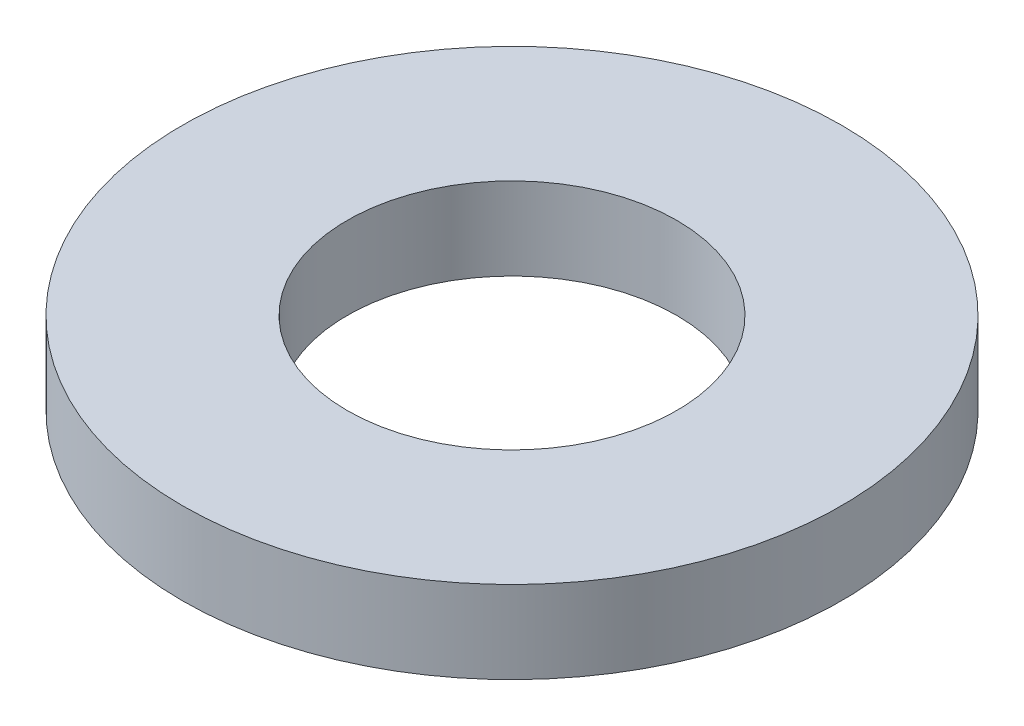
ISO-10303-21;
HEADER;
FILE_DESCRIPTION(('STEP AP214'),'2;1');
FILE_NAME('part.step','',(''),(''),'','','');
FILE_SCHEMA(('AUTOMOTIVE_DESIGN { 1 0 10303 214 1 1 1 1 }'));
ENDSEC;
DATA;
#1=APPLICATION_CONTEXT('core data for automotive mechanical design processes');
#2=APPLICATION_PROTOCOL_DEFINITION('international standard','automotive_design',2000,#1);
#3=PRODUCT_CONTEXT('',#1,'mechanical');
#4=PRODUCT('Part','Part','',(#3));
#5=PRODUCT_RELATED_PRODUCT_CATEGORY('part','',(#4));
#6=PRODUCT_DEFINITION_FORMATION('','',#4);
#7=PRODUCT_DEFINITION_CONTEXT('part definition',#1,'design');
#8=PRODUCT_DEFINITION('design','',#6,#7);
#9=PRODUCT_DEFINITION_SHAPE('','',#8);
#10=(LENGTH_UNIT() NAMED_UNIT(*) SI_UNIT(.MILLI.,.METRE.));
#11=(NAMED_UNIT(*) PLANE_ANGLE_UNIT() SI_UNIT($,.RADIAN.));
#12=(NAMED_UNIT(*) SI_UNIT($,.STERADIAN.) SOLID_ANGLE_UNIT());
#13=UNCERTAINTY_MEASURE_WITH_UNIT(LENGTH_MEASURE(1.E-05),#10,'distance_accuracy_value','');
#14=(GEOMETRIC_REPRESENTATION_CONTEXT(3) GLOBAL_UNCERTAINTY_ASSIGNED_CONTEXT((#13)) GLOBAL_UNIT_ASSIGNED_CONTEXT((#10,
#11,#12)) REPRESENTATION_CONTEXT('',''));
#15=CARTESIAN_POINT('',(0.,0.,0.));
#16=DIRECTION('',(0.,0.,1.));
#17=DIRECTION('',(1.,0.,0.));
#18=AXIS2_PLACEMENT_3D('',#15,#16,#17);
#19=CARTESIAN_POINT('',(0.,1.,0.));
#20=DIRECTION('',(0.,1.,0.));
#21=DIRECTION('',(0.,0.,1.));
#22=AXIS2_PLACEMENT_3D('',#19,#20,#21);
#23=PLANE('',#22);
#24=CARTESIAN_POINT('',(0.,1.,0.));
#25=DIRECTION('',(0.,1.,0.));
#26=DIRECTION('',(0.,0.,1.));
#27=AXIS2_PLACEMENT_3D('',#24,#25,#26);
#28=CIRCLE('',#27,4.);
#29=CARTESIAN_POINT('',(0.,1.,4.));
#30=VERTEX_POINT('',#29);
#31=EDGE_CURVE('E10',#30,#30,#28,.T.);
#32=ORIENTED_EDGE('',*,*,#31,.T.);
#33=EDGE_LOOP('',(#32));
#34=FACE_BOUND('',#33,.T.);
#35=CARTESIAN_POINT('',(0.,1.,0.));
#36=DIRECTION('',(0.,1.,0.));
#37=DIRECTION('',(0.,0.,1.));
#38=AXIS2_PLACEMENT_3D('',#35,#36,#37);
#39=CIRCLE('',#38,2.);
#40=CARTESIAN_POINT('',(0.,1.,2.));
#41=VERTEX_POINT('',#40);
#42=EDGE_CURVE('E48',#41,#41,#39,.T.);
#43=ORIENTED_EDGE('',*,*,#42,.F.);
#44=EDGE_LOOP('',(#43));
#45=FACE_BOUND('',#44,.T.);
#46=ADVANCED_FACE('F37',(#34,#45),#23,.T.);
#47=CARTESIAN_POINT('',(0.,0.,0.));
#48=DIRECTION('',(0.,1.,0.));
#49=DIRECTION('',(0.,0.,1.));
#50=AXIS2_PLACEMENT_3D('',#47,#48,#49);
#51=PLANE('',#50);
#52=CARTESIAN_POINT('',(0.,0.,0.));
#53=DIRECTION('',(0.,1.,0.));
#54=DIRECTION('',(0.,0.,1.));
#55=AXIS2_PLACEMENT_3D('',#52,#53,#54);
#56=CIRCLE('',#55,4.);
#57=CARTESIAN_POINT('',(0.,0.,4.));
#58=VERTEX_POINT('',#57);
#59=EDGE_CURVE('E41',#58,#58,#56,.T.);
#60=ORIENTED_EDGE('',*,*,#59,.F.);
#61=EDGE_LOOP('',(#60));
#62=FACE_BOUND('',#61,.T.);
#63=CARTESIAN_POINT('',(0.,0.,0.));
#64=DIRECTION('',(0.,1.,0.));
#65=DIRECTION('',(0.,0.,1.));
#66=AXIS2_PLACEMENT_3D('',#63,#64,#65);
#67=CIRCLE('',#66,2.);
#68=CARTESIAN_POINT('',(0.,0.,2.));
#69=VERTEX_POINT('',#68);
#70=EDGE_CURVE('E50',#69,#69,#67,.T.);
#71=ORIENTED_EDGE('',*,*,#70,.T.);
#72=EDGE_LOOP('',(#71));
#73=FACE_BOUND('',#72,.T.);
#74=ADVANCED_FACE('F60',(#62,#73),#51,.F.);
#75=CARTESIAN_POINT('',(0.,1.,0.));
#76=DIRECTION('',(0.,-1.,0.));
#77=DIRECTION('',(0.,0.,-1.));
#78=AXIS2_PLACEMENT_3D('',#75,#76,#77);
#79=CYLINDRICAL_SURFACE('',#78,4.);
#80=ORIENTED_EDGE('',*,*,#31,.F.);
#81=EDGE_LOOP('',(#80));
#82=FACE_BOUND('',#81,.T.);
#83=ORIENTED_EDGE('',*,*,#59,.T.);
#84=EDGE_LOOP('',(#83));
#85=FACE_BOUND('',#84,.T.);
#86=ADVANCED_FACE('F39',(#82,#85),#79,.T.);
#87=CARTESIAN_POINT('',(0.,1.,0.));
#88=DIRECTION('',(0.,-1.,0.));
#89=DIRECTION('',(0.,0.,-1.));
#90=AXIS2_PLACEMENT_3D('',#87,#88,#89);
#91=CYLINDRICAL_SURFACE('',#90,2.);
#92=ORIENTED_EDGE('',*,*,#42,.T.);
#93=EDGE_LOOP('',(#92));
#94=FACE_BOUND('',#93,.T.);
#95=ORIENTED_EDGE('',*,*,#70,.F.);
#96=EDGE_LOOP('',(#95));
#97=FACE_BOUND('',#96,.T.);
#98=ADVANCED_FACE('F56',(#94,#97),#91,.F.);
#99=CLOSED_SHELL('',(#46,#74,#86,#98));
#100=MANIFOLD_SOLID_BREP('B2',#99);
#101=ADVANCED_BREP_SHAPE_REPRESENTATION('',(#18,#100),#14);
#102=SHAPE_DEFINITION_REPRESENTATION(#9,#101);
ENDSEC;
END-ISO-10303-21;
